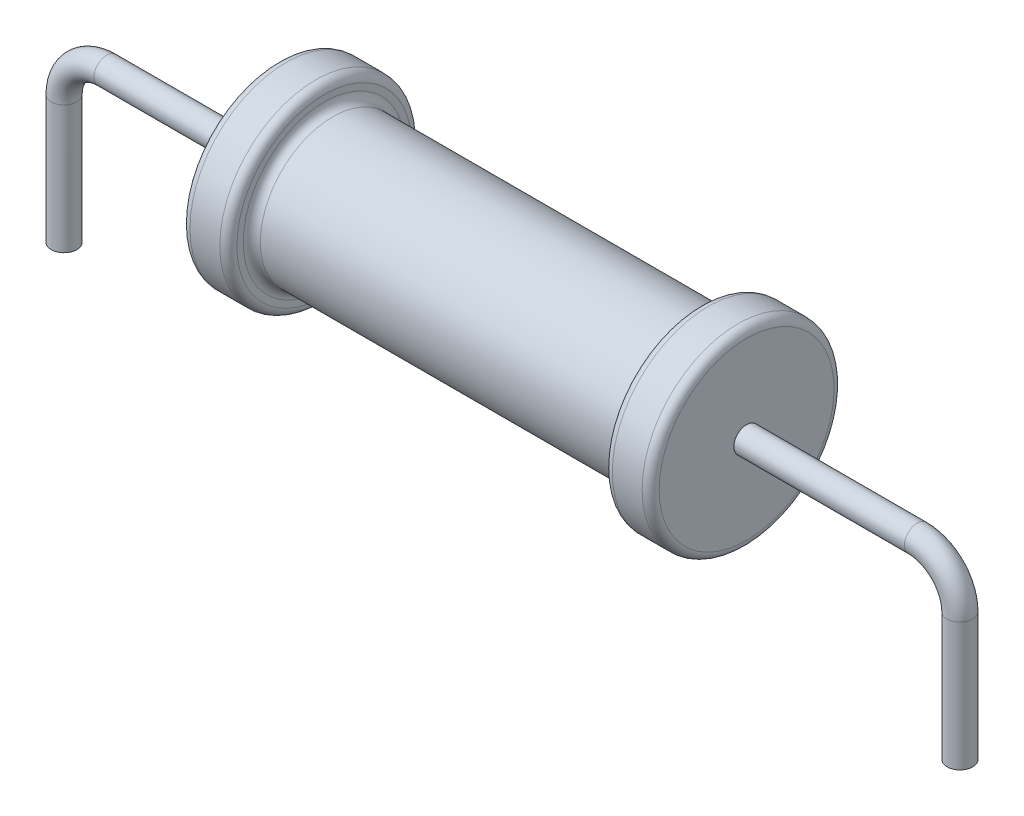
ISO-10303-21;
HEADER;
FILE_DESCRIPTION(('STEP AP214'),'2;1');
FILE_NAME('part.step','',(''),(''),'','','');
FILE_SCHEMA(('AUTOMOTIVE_DESIGN { 1 0 10303 214 1 1 1 1 }'));
ENDSEC;
DATA;
#1=APPLICATION_CONTEXT('core data for automotive mechanical design processes');
#2=APPLICATION_PROTOCOL_DEFINITION('international standard','automotive_design',2000,#1);
#3=PRODUCT_CONTEXT('',#1,'mechanical');
#4=PRODUCT('Part','Part','',(#3));
#5=PRODUCT_RELATED_PRODUCT_CATEGORY('part','',(#4));
#6=PRODUCT_DEFINITION_FORMATION('','',#4);
#7=PRODUCT_DEFINITION_CONTEXT('part definition',#1,'design');
#8=PRODUCT_DEFINITION('design','',#6,#7);
#9=PRODUCT_DEFINITION_SHAPE('','',#8);
#10=(LENGTH_UNIT() NAMED_UNIT(*) SI_UNIT(.MILLI.,.METRE.));
#11=(NAMED_UNIT(*) PLANE_ANGLE_UNIT() SI_UNIT($,.RADIAN.));
#12=(NAMED_UNIT(*) SI_UNIT($,.STERADIAN.) SOLID_ANGLE_UNIT());
#13=UNCERTAINTY_MEASURE_WITH_UNIT(LENGTH_MEASURE(1.E-05),#10,'distance_accuracy_value','');
#14=(GEOMETRIC_REPRESENTATION_CONTEXT(3) GLOBAL_UNCERTAINTY_ASSIGNED_CONTEXT((#13)) GLOBAL_UNIT_ASSIGNED_CONTEXT((#10,
#11,#12)) REPRESENTATION_CONTEXT('',''));
#15=CARTESIAN_POINT('',(0.,0.,0.));
#16=DIRECTION('',(0.,0.,1.));
#17=DIRECTION('',(1.,0.,0.));
#18=AXIS2_PLACEMENT_3D('',#15,#16,#17);
#19=CARTESIAN_POINT('',(-5.42204724409449,0.,-2.05));
#20=DIRECTION('',(1.,0.,0.));
#21=DIRECTION('',(0.,0.,-1.));
#22=AXIS2_PLACEMENT_3D('',#19,#20,#21);
#23=PLANE('',#22);
#24=CARTESIAN_POINT('',(-5.42204724409449,0.,0.));
#25=DIRECTION('',(1.,0.,0.));
#26=DIRECTION('',(0.,0.,-1.));
#27=AXIS2_PLACEMENT_3D('',#24,#25,#26);
#28=CIRCLE('',#27,0.3);
#29=CARTESIAN_POINT('',(-5.42204724409449,0.,-0.3));
#30=VERTEX_POINT('',#29);
#31=EDGE_CURVE('E67',#30,#30,#28,.F.);
#32=ORIENTED_EDGE('',*,*,#31,.F.);
#33=EDGE_LOOP('',(#32));
#34=FACE_BOUND('',#33,.T.);
#35=CARTESIAN_POINT('',(-5.42204724409449,0.,0.));
#36=DIRECTION('',(-1.,0.,0.));
#37=DIRECTION('',(0.,0.,1.));
#38=AXIS2_PLACEMENT_3D('',#35,#36,#37);
#39=CIRCLE('',#38,2.05);
#40=CARTESIAN_POINT('',(-5.42204724409449,0.,2.05));
#41=VERTEX_POINT('',#40);
#42=EDGE_CURVE('E107',#41,#41,#39,.T.);
#43=ORIENTED_EDGE('',*,*,#42,.T.);
#44=EDGE_LOOP('',(#43));
#45=FACE_BOUND('',#44,.T.);
#46=ADVANCED_FACE('F61',(#34,#45),#23,.F.);
#47=CARTESIAN_POINT('',(5.57795275590551,0.,0.));
#48=DIRECTION('',(-1.,0.,0.));
#49=DIRECTION('',(0.,0.,1.));
#50=AXIS2_PLACEMENT_3D('',#47,#48,#49);
#51=PLANE('',#50);
#52=CARTESIAN_POINT('',(5.57795275590551,0.,0.));
#53=DIRECTION('',(-1.,0.,0.));
#54=DIRECTION('',(0.,0.,1.));
#55=AXIS2_PLACEMENT_3D('',#52,#53,#54);
#56=CIRCLE('',#55,0.3);
#57=CARTESIAN_POINT('',(5.57795275590551,0.,0.3));
#58=VERTEX_POINT('',#57);
#59=EDGE_CURVE('E11',#58,#58,#56,.F.);
#60=ORIENTED_EDGE('',*,*,#59,.F.);
#61=EDGE_LOOP('',(#60));
#62=FACE_BOUND('',#61,.T.);
#63=CARTESIAN_POINT('',(5.57795275590551,0.,0.));
#64=DIRECTION('',(-1.,0.,0.));
#65=DIRECTION('',(0.,0.,1.));
#66=AXIS2_PLACEMENT_3D('',#63,#64,#65);
#67=CIRCLE('',#66,2.05);
#68=CARTESIAN_POINT('',(5.57795275590551,0.,2.05));
#69=VERTEX_POINT('',#68);
#70=EDGE_CURVE('E71',#69,#69,#67,.T.);
#71=ORIENTED_EDGE('',*,*,#70,.F.);
#72=EDGE_LOOP('',(#71));
#73=FACE_BOUND('',#72,.T.);
#74=ADVANCED_FACE('F146',(#62,#73),#51,.F.);
#75=CARTESIAN_POINT('',(5.37795275590551,0.,0.));
#76=DIRECTION('',(-1.,0.,0.));
#77=DIRECTION('',(0.,0.,1.));
#78=AXIS2_PLACEMENT_3D('',#75,#76,#77);
#79=TOROIDAL_SURFACE('',#78,2.05,0.2);
#80=CARTESIAN_POINT('',(5.37795275590551,0.,0.));
#81=DIRECTION('',(-1.,0.,0.));
#82=DIRECTION('',(0.,0.,1.));
#83=AXIS2_PLACEMENT_3D('',#80,#81,#82);
#84=CIRCLE('',#83,2.25);
#85=CARTESIAN_POINT('',(5.37795275590551,0.,2.25));
#86=VERTEX_POINT('',#85);
#87=EDGE_CURVE('E75',#86,#86,#84,.T.);
#88=ORIENTED_EDGE('',*,*,#87,.F.);
#89=EDGE_LOOP('',(#88));
#90=FACE_BOUND('',#89,.T.);
#91=ORIENTED_EDGE('',*,*,#70,.T.);
#92=EDGE_LOOP('',(#91));
#93=FACE_BOUND('',#92,.T.);
#94=ADVANCED_FACE('F151',(#90,#93),#79,.T.);
#95=CARTESIAN_POINT('',(-5.42204724409449,0.,0.));
#96=DIRECTION('',(-1.,0.,0.));
#97=DIRECTION('',(0.,0.,1.));
#98=AXIS2_PLACEMENT_3D('',#95,#96,#97);
#99=CYLINDRICAL_SURFACE('',#98,2.25);
#100=CARTESIAN_POINT('',(4.67795275590551,0.,0.));
#101=DIRECTION('',(-1.,0.,0.));
#102=DIRECTION('',(0.,0.,1.));
#103=AXIS2_PLACEMENT_3D('',#100,#101,#102);
#104=CIRCLE('',#103,2.25);
#105=CARTESIAN_POINT('',(4.67795275590551,0.,2.25));
#106=VERTEX_POINT('',#105);
#107=EDGE_CURVE('E80',#106,#106,#104,.T.);
#108=ORIENTED_EDGE('',*,*,#107,.F.);
#109=EDGE_LOOP('',(#108));
#110=FACE_BOUND('',#109,.T.);
#111=ORIENTED_EDGE('',*,*,#87,.T.);
#112=EDGE_LOOP('',(#111));
#113=FACE_BOUND('',#112,.T.);
#114=ADVANCED_FACE('F208',(#110,#113),#99,.T.);
#115=CARTESIAN_POINT('',(4.67795275590551,0.,0.));
#116=DIRECTION('',(-1.,0.,0.));
#117=DIRECTION('',(0.,0.,1.));
#118=AXIS2_PLACEMENT_3D('',#115,#116,#117);
#119=TOROIDAL_SURFACE('',#118,2.05,0.2);
#120=CARTESIAN_POINT('',(4.47795275590551,0.,0.));
#121=DIRECTION('',(-1.,0.,0.));
#122=DIRECTION('',(0.,0.,1.));
#123=AXIS2_PLACEMENT_3D('',#120,#121,#122);
#124=CIRCLE('',#123,2.05);
#125=CARTESIAN_POINT('',(4.47795275590551,0.,2.05));
#126=VERTEX_POINT('',#125);
#127=EDGE_CURVE('E83',#126,#126,#124,.T.);
#128=ORIENTED_EDGE('',*,*,#127,.F.);
#129=EDGE_LOOP('',(#128));
#130=FACE_BOUND('',#129,.T.);
#131=ORIENTED_EDGE('',*,*,#107,.T.);
#132=EDGE_LOOP('',(#131));
#133=FACE_BOUND('',#132,.T.);
#134=ADVANCED_FACE('F202',(#130,#133),#119,.T.);
#135=CARTESIAN_POINT('',(4.47795275590551,0.,-2.05));
#136=DIRECTION('',(1.,0.,0.));
#137=DIRECTION('',(0.,0.,-1.));
#138=AXIS2_PLACEMENT_3D('',#135,#136,#137);
#139=PLANE('',#138);
#140=CARTESIAN_POINT('',(4.47795275590551,0.,0.));
#141=DIRECTION('',(-1.,0.,0.));
#142=DIRECTION('',(0.,0.,1.));
#143=AXIS2_PLACEMENT_3D('',#140,#141,#142);
#144=CIRCLE('',#143,1.9);
#145=CARTESIAN_POINT('',(4.47795275590551,0.,1.9));
#146=VERTEX_POINT('',#145);
#147=EDGE_CURVE('E86',#146,#146,#144,.T.);
#148=ORIENTED_EDGE('',*,*,#147,.F.);
#149=EDGE_LOOP('',(#148));
#150=FACE_BOUND('',#149,.T.);
#151=ORIENTED_EDGE('',*,*,#127,.T.);
#152=EDGE_LOOP('',(#151));
#153=FACE_BOUND('',#152,.T.);
#154=ADVANCED_FACE('F196',(#150,#153),#139,.F.);
#155=CARTESIAN_POINT('',(4.27795275590551,0.,0.));
#156=DIRECTION('',(-1.,0.,0.));
#157=DIRECTION('',(0.,0.,1.));
#158=AXIS2_PLACEMENT_3D('',#155,#156,#157);
#159=TOROIDAL_SURFACE('',#158,1.9,0.2);
#160=CARTESIAN_POINT('',(4.27795275590551,0.,0.));
#161=DIRECTION('',(-1.,0.,0.));
#162=DIRECTION('',(0.,0.,1.));
#163=AXIS2_PLACEMENT_3D('',#160,#161,#162);
#164=CIRCLE('',#163,1.7);
#165=CARTESIAN_POINT('',(4.27795275590551,0.,1.7));
#166=VERTEX_POINT('',#165);
#167=EDGE_CURVE('E89',#166,#166,#164,.T.);
#168=ORIENTED_EDGE('',*,*,#167,.F.);
#169=EDGE_LOOP('',(#168));
#170=FACE_BOUND('',#169,.T.);
#171=ORIENTED_EDGE('',*,*,#147,.T.);
#172=EDGE_LOOP('',(#171));
#173=FACE_BOUND('',#172,.T.);
#174=ADVANCED_FACE('F190',(#170,#173),#159,.F.);
#175=CARTESIAN_POINT('',(-5.42204724409449,0.,0.));
#176=DIRECTION('',(-1.,0.,0.));
#177=DIRECTION('',(0.,0.,1.));
#178=AXIS2_PLACEMENT_3D('',#175,#176,#177);
#179=CYLINDRICAL_SURFACE('',#178,1.7);
#180=CARTESIAN_POINT('',(-4.12204724409449,0.,0.));
#181=DIRECTION('',(-1.,0.,0.));
#182=DIRECTION('',(0.,0.,1.));
#183=AXIS2_PLACEMENT_3D('',#180,#181,#182);
#184=CIRCLE('',#183,1.7);
#185=CARTESIAN_POINT('',(-4.12204724409449,0.,1.7));
#186=VERTEX_POINT('',#185);
#187=EDGE_CURVE('E92',#186,#186,#184,.T.);
#188=ORIENTED_EDGE('',*,*,#187,.F.);
#189=EDGE_LOOP('',(#188));
#190=FACE_BOUND('',#189,.T.);
#191=ORIENTED_EDGE('',*,*,#167,.T.);
#192=EDGE_LOOP('',(#191));
#193=FACE_BOUND('',#192,.T.);
#194=ADVANCED_FACE('F184',(#190,#193),#179,.T.);
#195=CARTESIAN_POINT('',(-4.12204724409449,0.,0.));
#196=DIRECTION('',(-1.,0.,0.));
#197=DIRECTION('',(0.,0.,1.));
#198=AXIS2_PLACEMENT_3D('',#195,#196,#197);
#199=TOROIDAL_SURFACE('',#198,1.9,0.2);
#200=CARTESIAN_POINT('',(-4.32204724409449,0.,0.));
#201=DIRECTION('',(-1.,0.,0.));
#202=DIRECTION('',(0.,0.,1.));
#203=AXIS2_PLACEMENT_3D('',#200,#201,#202);
#204=CIRCLE('',#203,1.9);
#205=CARTESIAN_POINT('',(-4.32204724409449,0.,1.9));
#206=VERTEX_POINT('',#205);
#207=EDGE_CURVE('E95',#206,#206,#204,.T.);
#208=ORIENTED_EDGE('',*,*,#207,.F.);
#209=EDGE_LOOP('',(#208));
#210=FACE_BOUND('',#209,.T.);
#211=ORIENTED_EDGE('',*,*,#187,.T.);
#212=EDGE_LOOP('',(#211));
#213=FACE_BOUND('',#212,.T.);
#214=ADVANCED_FACE('F178',(#210,#213),#199,.F.);
#215=CARTESIAN_POINT('',(-4.32204724409449,0.,-1.9));
#216=DIRECTION('',(-1.,0.,0.));
#217=DIRECTION('',(0.,0.,1.));
#218=AXIS2_PLACEMENT_3D('',#215,#216,#217);
#219=PLANE('',#218);
#220=CARTESIAN_POINT('',(-4.32204724409449,0.,0.));
#221=DIRECTION('',(-1.,0.,0.));
#222=DIRECTION('',(0.,0.,1.));
#223=AXIS2_PLACEMENT_3D('',#220,#221,#222);
#224=CIRCLE('',#223,2.05);
#225=CARTESIAN_POINT('',(-4.32204724409449,0.,2.05));
#226=VERTEX_POINT('',#225);
#227=EDGE_CURVE('E98',#226,#226,#224,.T.);
#228=ORIENTED_EDGE('',*,*,#227,.F.);
#229=EDGE_LOOP('',(#228));
#230=FACE_BOUND('',#229,.T.);
#231=ORIENTED_EDGE('',*,*,#207,.T.);
#232=EDGE_LOOP('',(#231));
#233=FACE_BOUND('',#232,.T.);
#234=ADVANCED_FACE('F172',(#230,#233),#219,.F.);
#235=CARTESIAN_POINT('',(-4.52204724409449,0.,0.));
#236=DIRECTION('',(-1.,0.,0.));
#237=DIRECTION('',(0.,0.,1.));
#238=AXIS2_PLACEMENT_3D('',#235,#236,#237);
#239=TOROIDAL_SURFACE('',#238,2.05,0.2);
#240=CARTESIAN_POINT('',(-4.52204724409449,0.,0.));
#241=DIRECTION('',(-1.,0.,0.));
#242=DIRECTION('',(0.,0.,1.));
#243=AXIS2_PLACEMENT_3D('',#240,#241,#242);
#244=CIRCLE('',#243,2.25);
#245=CARTESIAN_POINT('',(-4.52204724409449,0.,2.25));
#246=VERTEX_POINT('',#245);
#247=EDGE_CURVE('E101',#246,#246,#244,.T.);
#248=ORIENTED_EDGE('',*,*,#247,.F.);
#249=EDGE_LOOP('',(#248));
#250=FACE_BOUND('',#249,.T.);
#251=ORIENTED_EDGE('',*,*,#227,.T.);
#252=EDGE_LOOP('',(#251));
#253=FACE_BOUND('',#252,.T.);
#254=ADVANCED_FACE('F166',(#250,#253),#239,.T.);
#255=CARTESIAN_POINT('',(-5.42204724409449,0.,0.));
#256=DIRECTION('',(-1.,0.,0.));
#257=DIRECTION('',(0.,0.,1.));
#258=AXIS2_PLACEMENT_3D('',#255,#256,#257);
#259=CYLINDRICAL_SURFACE('',#258,2.25);
#260=CARTESIAN_POINT('',(-5.22204724409449,0.,0.));
#261=DIRECTION('',(-1.,0.,0.));
#262=DIRECTION('',(0.,0.,1.));
#263=AXIS2_PLACEMENT_3D('',#260,#261,#262);
#264=CIRCLE('',#263,2.25);
#265=CARTESIAN_POINT('',(-5.22204724409449,0.,2.25));
#266=VERTEX_POINT('',#265);
#267=EDGE_CURVE('E104',#266,#266,#264,.T.);
#268=ORIENTED_EDGE('',*,*,#267,.F.);
#269=EDGE_LOOP('',(#268));
#270=FACE_BOUND('',#269,.T.);
#271=ORIENTED_EDGE('',*,*,#247,.T.);
#272=EDGE_LOOP('',(#271));
#273=FACE_BOUND('',#272,.T.);
#274=ADVANCED_FACE('F159',(#270,#273),#259,.T.);
#275=CARTESIAN_POINT('',(-5.22204724409449,0.,0.));
#276=DIRECTION('',(-1.,0.,0.));
#277=DIRECTION('',(0.,0.,1.));
#278=AXIS2_PLACEMENT_3D('',#275,#276,#277);
#279=TOROIDAL_SURFACE('',#278,2.05,0.2);
#280=ORIENTED_EDGE('',*,*,#42,.F.);
#281=EDGE_LOOP('',(#280));
#282=FACE_BOUND('',#281,.T.);
#283=ORIENTED_EDGE('',*,*,#267,.T.);
#284=EDGE_LOOP('',(#283));
#285=FACE_BOUND('',#284,.T.);
#286=ADVANCED_FACE('F156',(#282,#285),#279,.T.);
#287=CARTESIAN_POINT('',(-10.4220472440945,-4.,0.));
#288=DIRECTION('',(0.,1.,0.));
#289=DIRECTION('',(0.,0.,1.));
#290=AXIS2_PLACEMENT_3D('',#287,#288,#289);
#291=PLANE('',#290);
#292=CARTESIAN_POINT('',(-10.4220472440945,-4.,0.));
#293=DIRECTION('',(0.,1.,0.));
#294=DIRECTION('',(0.,0.,1.));
#295=AXIS2_PLACEMENT_3D('',#292,#293,#294);
#296=CIRCLE('',#295,0.3);
#297=CARTESIAN_POINT('',(-10.4220472440945,-4.,0.3));
#298=VERTEX_POINT('',#297);
#299=EDGE_CURVE('E110',#298,#298,#296,.T.);
#300=ORIENTED_EDGE('',*,*,#299,.F.);
#301=EDGE_LOOP('',(#300));
#302=FACE_BOUND('',#301,.T.);
#303=ADVANCED_FACE('F142',(#302),#291,.F.);
#304=CARTESIAN_POINT('',(-5.42204724409449,0.,0.));
#305=DIRECTION('',(-1.,0.,0.));
#306=DIRECTION('',(0.,-1.,0.));
#307=AXIS2_PLACEMENT_3D('',#304,#305,#306);
#308=CYLINDRICAL_SURFACE('',#307,0.3);
#309=CARTESIAN_POINT('',(-9.42204724409449,0.,0.));
#310=DIRECTION('',(1.,0.,0.));
#311=DIRECTION('',(0.,0.,1.));
#312=AXIS2_PLACEMENT_3D('',#309,#310,#311);
#313=CIRCLE('',#312,0.3);
#314=CARTESIAN_POINT('',(-9.42204724409449,0.3,0.));
#315=VERTEX_POINT('',#314);
#316=EDGE_CURVE('E116',#315,#315,#313,.T.);
#317=ORIENTED_EDGE('',*,*,#316,.T.);
#318=EDGE_LOOP('',(#317));
#319=FACE_BOUND('',#318,.T.);
#320=ORIENTED_EDGE('',*,*,#31,.T.);
#321=EDGE_LOOP('',(#320));
#322=FACE_BOUND('',#321,.T.);
#323=ADVANCED_FACE('F227',(#319,#322),#308,.T.);
#324=CARTESIAN_POINT('',(-9.42204724409449,-1.,0.));
#325=DIRECTION('',(0.,0.,1.));
#326=DIRECTION('',(1.,0.,0.));
#327=AXIS2_PLACEMENT_3D('',#324,#325,#326);
#328=TOROIDAL_SURFACE('',#327,1.,0.3);
#329=CARTESIAN_POINT('',(-10.4220472440945,-1.,0.));
#330=DIRECTION('',(0.,1.,0.));
#331=DIRECTION('',(0.,0.,1.));
#332=AXIS2_PLACEMENT_3D('',#329,#330,#331);
#333=CIRCLE('',#332,0.3);
#334=CARTESIAN_POINT('',(-10.7220472440945,-1.,0.));
#335=VERTEX_POINT('',#334);
#336=EDGE_CURVE('E113',#335,#335,#333,.T.);
#337=CARTESIAN_POINT('',(-9.42204724409449,-1.,0.));
#338=DIRECTION('',(0.,0.,1.));
#339=DIRECTION('',(1.,0.,0.));
#340=AXIS2_PLACEMENT_3D('',#337,#338,#339);
#341=CIRCLE('',#340,1.3);
#342=EDGE_CURVE('',#315,#335,#341,.T.);
#343=ORIENTED_EDGE('',*,*,#316,.F.);
#344=ORIENTED_EDGE('',*,*,#336,.T.);
#345=ORIENTED_EDGE('',*,*,#342,.T.);
#346=ORIENTED_EDGE('',*,*,#342,.F.);
#347=EDGE_LOOP('',(#343,#345,#344,#346));
#348=FACE_BOUND('',#347,.T.);
#349=ADVANCED_FACE('F231',(#348),#328,.T.);
#350=CARTESIAN_POINT('',(-10.4220472440945,-0.999999999999999,0.));
#351=DIRECTION('',(0.,-1.,0.));
#352=DIRECTION('',(0.,0.,-1.));
#353=AXIS2_PLACEMENT_3D('',#350,#351,#352);
#354=CYLINDRICAL_SURFACE('',#353,0.3);
#355=ORIENTED_EDGE('',*,*,#299,.T.);
#356=EDGE_LOOP('',(#355));
#357=FACE_BOUND('',#356,.T.);
#358=ORIENTED_EDGE('',*,*,#336,.F.);
#359=EDGE_LOOP('',(#358));
#360=FACE_BOUND('',#359,.T.);
#361=ADVANCED_FACE('F161',(#357,#360),#354,.T.);
#362=CARTESIAN_POINT('',(10.5779527559055,-4.,0.));
#363=DIRECTION('',(0.,1.,0.));
#364=DIRECTION('',(0.,0.,1.));
#365=AXIS2_PLACEMENT_3D('',#362,#363,#364);
#366=PLANE('',#365);
#367=CARTESIAN_POINT('',(10.5779527559055,-4.,0.));
#368=DIRECTION('',(0.,1.,0.));
#369=DIRECTION('',(0.,0.,1.));
#370=AXIS2_PLACEMENT_3D('',#367,#368,#369);
#371=CIRCLE('',#370,0.3);
#372=CARTESIAN_POINT('',(10.5779527559055,-4.,0.3));
#373=VERTEX_POINT('',#372);
#374=EDGE_CURVE('E119',#373,#373,#371,.T.);
#375=ORIENTED_EDGE('',*,*,#374,.F.);
#376=EDGE_LOOP('',(#375));
#377=FACE_BOUND('',#376,.T.);
#378=ADVANCED_FACE('F143',(#377),#366,.F.);
#379=CARTESIAN_POINT('',(5.57795275590551,0.,0.));
#380=DIRECTION('',(1.,0.,0.));
#381=DIRECTION('',(0.,0.,-1.));
#382=AXIS2_PLACEMENT_3D('',#379,#380,#381);
#383=CYLINDRICAL_SURFACE('',#382,0.3);
#384=CARTESIAN_POINT('',(9.57795275590551,0.,0.));
#385=DIRECTION('',(-1.,0.,0.));
#386=DIRECTION('',(0.,0.,1.));
#387=AXIS2_PLACEMENT_3D('',#384,#385,#386);
#388=CIRCLE('',#387,0.3);
#389=CARTESIAN_POINT('',(9.57795275590551,0.3,0.));
#390=VERTEX_POINT('',#389);
#391=EDGE_CURVE('E125',#390,#390,#388,.T.);
#392=ORIENTED_EDGE('',*,*,#391,.T.);
#393=EDGE_LOOP('',(#392));
#394=FACE_BOUND('',#393,.T.);
#395=ORIENTED_EDGE('',*,*,#59,.T.);
#396=EDGE_LOOP('',(#395));
#397=FACE_BOUND('',#396,.T.);
#398=ADVANCED_FACE('F129',(#394,#397),#383,.T.);
#399=CARTESIAN_POINT('',(9.57795275590551,-1.,0.));
#400=DIRECTION('',(0.,0.,-1.));
#401=DIRECTION('',(-1.,0.,0.));
#402=AXIS2_PLACEMENT_3D('',#399,#400,#401);
#403=TOROIDAL_SURFACE('',#402,1.,0.3);
#404=CARTESIAN_POINT('',(10.5779527559055,-1.,0.));
#405=DIRECTION('',(0.,1.,0.));
#406=DIRECTION('',(0.,0.,1.));
#407=AXIS2_PLACEMENT_3D('',#404,#405,#406);
#408=CIRCLE('',#407,0.3);
#409=CARTESIAN_POINT('',(10.8779527559055,-1.,0.));
#410=VERTEX_POINT('',#409);
#411=EDGE_CURVE('E122',#410,#410,#408,.T.);
#412=CARTESIAN_POINT('',(9.57795275590551,-1.,0.));
#413=DIRECTION('',(0.,0.,-1.));
#414=DIRECTION('',(-1.,0.,0.));
#415=AXIS2_PLACEMENT_3D('',#412,#413,#414);
#416=CIRCLE('',#415,1.3);
#417=EDGE_CURVE('',#390,#410,#416,.T.);
#418=ORIENTED_EDGE('',*,*,#391,.F.);
#419=ORIENTED_EDGE('',*,*,#411,.T.);
#420=ORIENTED_EDGE('',*,*,#417,.T.);
#421=ORIENTED_EDGE('',*,*,#417,.F.);
#422=EDGE_LOOP('',(#418,#420,#419,#421));
#423=FACE_BOUND('',#422,.T.);
#424=ADVANCED_FACE('F131',(#423),#403,.T.);
#425=CARTESIAN_POINT('',(10.5779527559055,-1.,0.));
#426=DIRECTION('',(0.,-1.,0.));
#427=DIRECTION('',(0.,0.,-1.));
#428=AXIS2_PLACEMENT_3D('',#425,#426,#427);
#429=CYLINDRICAL_SURFACE('',#428,0.3);
#430=ORIENTED_EDGE('',*,*,#374,.T.);
#431=EDGE_LOOP('',(#430));
#432=FACE_BOUND('',#431,.T.);
#433=ORIENTED_EDGE('',*,*,#411,.F.);
#434=EDGE_LOOP('',(#433));
#435=FACE_BOUND('',#434,.T.);
#436=ADVANCED_FACE('F133',(#432,#435),#429,.T.);
#437=CLOSED_SHELL('',(#46,#74,#94,#114,#134,#154,#174,#194,#214,#234,#254,#274,#286,#303,#323,
#349,#361,#378,#398,#424,#436));
#438=MANIFOLD_SOLID_BREP('B2',#437);
#439=ADVANCED_BREP_SHAPE_REPRESENTATION('',(#18,#438),#14);
#440=SHAPE_DEFINITION_REPRESENTATION(#9,#439);
ENDSEC;
END-ISO-10303-21;
